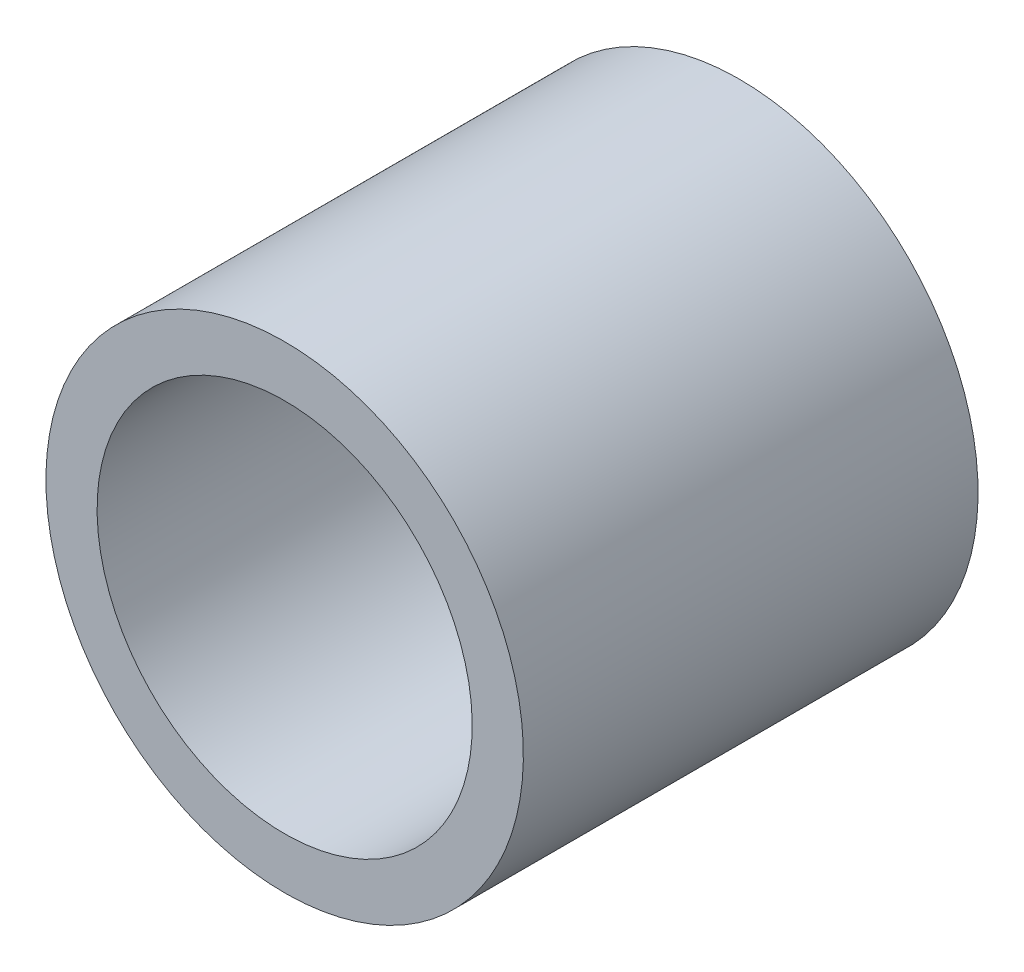
ISO-10303-21;
HEADER;
FILE_DESCRIPTION(('STEP AP214'),'2;1');
FILE_NAME('part.step','',(''),(''),'','','');
FILE_SCHEMA(('AUTOMOTIVE_DESIGN { 1 0 10303 214 1 1 1 1 }'));
ENDSEC;
DATA;
#1=APPLICATION_CONTEXT('core data for automotive mechanical design processes');
#2=APPLICATION_PROTOCOL_DEFINITION('international standard','automotive_design',2000,#1);
#3=PRODUCT_CONTEXT('',#1,'mechanical');
#4=PRODUCT('Part','Part','',(#3));
#5=PRODUCT_RELATED_PRODUCT_CATEGORY('part','',(#4));
#6=PRODUCT_DEFINITION_FORMATION('','',#4);
#7=PRODUCT_DEFINITION_CONTEXT('part definition',#1,'design');
#8=PRODUCT_DEFINITION('design','',#6,#7);
#9=PRODUCT_DEFINITION_SHAPE('','',#8);
#10=(LENGTH_UNIT() NAMED_UNIT(*) SI_UNIT(.MILLI.,.METRE.));
#11=(NAMED_UNIT(*) PLANE_ANGLE_UNIT() SI_UNIT($,.RADIAN.));
#12=(NAMED_UNIT(*) SI_UNIT($,.STERADIAN.) SOLID_ANGLE_UNIT());
#13=UNCERTAINTY_MEASURE_WITH_UNIT(LENGTH_MEASURE(1.E-05),#10,'distance_accuracy_value','');
#14=(GEOMETRIC_REPRESENTATION_CONTEXT(3) GLOBAL_UNCERTAINTY_ASSIGNED_CONTEXT((#13)) GLOBAL_UNIT_ASSIGNED_CONTEXT((#10,
#11,#12)) REPRESENTATION_CONTEXT('',''));
#15=CARTESIAN_POINT('',(0.,0.,0.));
#16=DIRECTION('',(0.,0.,1.));
#17=DIRECTION('',(1.,0.,0.));
#18=AXIS2_PLACEMENT_3D('',#15,#16,#17);
#19=CARTESIAN_POINT('',(6.49519052838339,3.75000000000071,15.5));
#20=DIRECTION('',(0.,0.,1.));
#21=DIRECTION('',(1.,0.,0.));
#22=AXIS2_PLACEMENT_3D('',#19,#20,#21);
#23=PLANE('',#22);
#24=CARTESIAN_POINT('',(6.49519052838339,3.75000000000071,15.5));
#25=DIRECTION('',(0.,0.,1.));
#26=DIRECTION('',(-0.5,0.86602540378444,0.));
#27=AXIS2_PLACEMENT_3D('',#24,#25,#26);
#28=CIRCLE('',#27,0.825);
#29=CARTESIAN_POINT('',(6.0826905283834,4.46447095812288,15.5));
#30=VERTEX_POINT('',#29);
#31=EDGE_CURVE('E11',#30,#30,#28,.T.);
#32=ORIENTED_EDGE('',*,*,#31,.T.);
#33=EDGE_LOOP('',(#32));
#34=FACE_BOUND('',#33,.T.);
#35=CARTESIAN_POINT('',(6.49519052838339,3.75000000000071,15.5));
#36=DIRECTION('',(0.,0.,1.));
#37=DIRECTION('',(-0.5,0.866025403784439,0.));
#38=AXIS2_PLACEMENT_3D('',#35,#36,#37);
#39=CIRCLE('',#38,1.05);
#40=CARTESIAN_POINT('',(5.9701905283834,4.65932667397437,15.5));
#41=VERTEX_POINT('',#40);
#42=EDGE_CURVE('E53',#41,#41,#39,.T.);
#43=ORIENTED_EDGE('',*,*,#42,.F.);
#44=EDGE_LOOP('',(#43));
#45=FACE_BOUND('',#44,.T.);
#46=ADVANCED_FACE('F16',(#34,#45),#23,.F.);
#47=CARTESIAN_POINT('',(6.49519052838339,3.75000000000071,17.5));
#48=DIRECTION('',(0.,0.,1.));
#49=DIRECTION('',(1.,0.,0.));
#50=AXIS2_PLACEMENT_3D('',#47,#48,#49);
#51=PLANE('',#50);
#52=CARTESIAN_POINT('',(6.49519052838339,3.75000000000071,17.5));
#53=DIRECTION('',(0.,0.,1.));
#54=DIRECTION('',(-0.5,0.86602540378444,0.));
#55=AXIS2_PLACEMENT_3D('',#52,#53,#54);
#56=CIRCLE('',#55,0.825);
#57=CARTESIAN_POINT('',(6.0826905283834,4.46447095812288,17.5));
#58=VERTEX_POINT('',#57);
#59=EDGE_CURVE('E25',#58,#58,#56,.T.);
#60=ORIENTED_EDGE('',*,*,#59,.F.);
#61=EDGE_LOOP('',(#60));
#62=FACE_BOUND('',#61,.T.);
#63=CARTESIAN_POINT('',(6.49519052838339,3.75000000000071,17.5));
#64=DIRECTION('',(0.,0.,1.));
#65=DIRECTION('',(-0.5,0.866025403784439,0.));
#66=AXIS2_PLACEMENT_3D('',#63,#64,#65);
#67=CIRCLE('',#66,1.05);
#68=CARTESIAN_POINT('',(5.9701905283834,4.65932667397437,17.5));
#69=VERTEX_POINT('',#68);
#70=EDGE_CURVE('E50',#69,#69,#67,.T.);
#71=ORIENTED_EDGE('',*,*,#70,.T.);
#72=EDGE_LOOP('',(#71));
#73=FACE_BOUND('',#72,.T.);
#74=ADVANCED_FACE('F18',(#62,#73),#51,.T.);
#75=CARTESIAN_POINT('',(6.49519052838339,3.75000000000071,17.5));
#76=DIRECTION('',(0.,0.,-1.));
#77=DIRECTION('',(-0.5,0.86602540378444,0.));
#78=AXIS2_PLACEMENT_3D('',#75,#76,#77);
#79=CYLINDRICAL_SURFACE('',#78,0.825);
#80=ORIENTED_EDGE('',*,*,#31,.F.);
#81=EDGE_LOOP('',(#80));
#82=FACE_BOUND('',#81,.T.);
#83=ORIENTED_EDGE('',*,*,#59,.T.);
#84=EDGE_LOOP('',(#83));
#85=FACE_BOUND('',#84,.T.);
#86=ADVANCED_FACE('F73',(#82,#85),#79,.F.);
#87=CARTESIAN_POINT('',(6.49519052838339,3.75000000000071,17.5));
#88=DIRECTION('',(0.,0.,-1.));
#89=DIRECTION('',(-0.5,0.866025403784439,0.));
#90=AXIS2_PLACEMENT_3D('',#87,#88,#89);
#91=CYLINDRICAL_SURFACE('',#90,1.05);
#92=ORIENTED_EDGE('',*,*,#42,.T.);
#93=EDGE_LOOP('',(#92));
#94=FACE_BOUND('',#93,.T.);
#95=ORIENTED_EDGE('',*,*,#70,.F.);
#96=EDGE_LOOP('',(#95));
#97=FACE_BOUND('',#96,.T.);
#98=ADVANCED_FACE('F65',(#94,#97),#91,.T.);
#99=CLOSED_SHELL('',(#46,#74,#86,#98));
#100=MANIFOLD_SOLID_BREP('B1',#99);
#101=ADVANCED_BREP_SHAPE_REPRESENTATION('',(#18,#100),#14);
#102=SHAPE_DEFINITION_REPRESENTATION(#9,#101);
ENDSEC;
END-ISO-10303-21;
